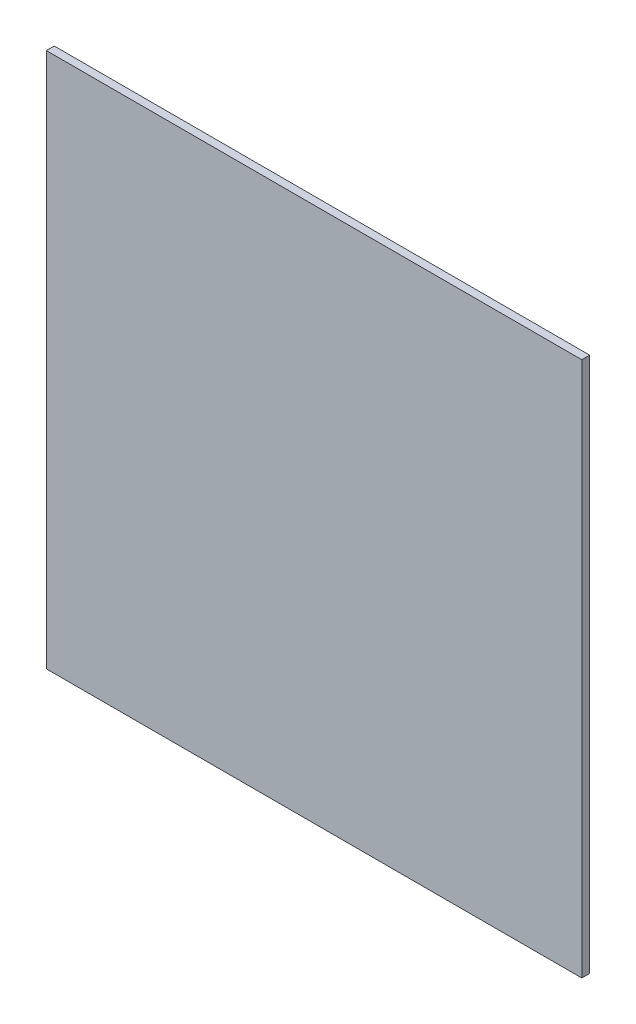
ISO-10303-21;
HEADER;
FILE_DESCRIPTION(('STEP AP214'),'2;1');
FILE_NAME('part.step','',(''),(''),'','','');
FILE_SCHEMA(('AUTOMOTIVE_DESIGN { 1 0 10303 214 1 1 1 1 }'));
ENDSEC;
DATA;
#1=APPLICATION_CONTEXT('core data for automotive mechanical design processes');
#2=APPLICATION_PROTOCOL_DEFINITION('international standard','automotive_design',2000,#1);
#3=PRODUCT_CONTEXT('',#1,'mechanical');
#4=PRODUCT('Part','Part','',(#3));
#5=PRODUCT_RELATED_PRODUCT_CATEGORY('part','',(#4));
#6=PRODUCT_DEFINITION_FORMATION('','',#4);
#7=PRODUCT_DEFINITION_CONTEXT('part definition',#1,'design');
#8=PRODUCT_DEFINITION('design','',#6,#7);
#9=PRODUCT_DEFINITION_SHAPE('','',#8);
#10=(LENGTH_UNIT() NAMED_UNIT(*) SI_UNIT(.MILLI.,.METRE.));
#11=(NAMED_UNIT(*) PLANE_ANGLE_UNIT() SI_UNIT($,.RADIAN.));
#12=(NAMED_UNIT(*) SI_UNIT($,.STERADIAN.) SOLID_ANGLE_UNIT());
#13=UNCERTAINTY_MEASURE_WITH_UNIT(LENGTH_MEASURE(1.E-05),#10,'distance_accuracy_value','');
#14=(GEOMETRIC_REPRESENTATION_CONTEXT(3) GLOBAL_UNCERTAINTY_ASSIGNED_CONTEXT((#13)) GLOBAL_UNIT_ASSIGNED_CONTEXT((#10,
#11,#12)) REPRESENTATION_CONTEXT('',''));
#15=CARTESIAN_POINT('',(0.,0.,0.));
#16=DIRECTION('',(0.,0.,1.));
#17=DIRECTION('',(1.,0.,0.));
#18=AXIS2_PLACEMENT_3D('',#15,#16,#17);
#19=CARTESIAN_POINT('',(-610.,-610.,-10.));
#20=DIRECTION('',(-1.,0.,0.));
#21=DIRECTION('',(0.,0.,1.));
#22=AXIS2_PLACEMENT_3D('',#19,#20,#21);
#23=PLANE('',#22);
#24=DIRECTION('',(0.,-1.,0.));
#25=VECTOR('',#24,1.);
#26=CARTESIAN_POINT('',(-610.,-610.,8.));
#27=LINE('',#26,#25);
#28=CARTESIAN_POINT('',(-610.,610.,8.));
#29=VERTEX_POINT('',#28);
#30=CARTESIAN_POINT('',(-610.,-610.,8.));
#31=VERTEX_POINT('',#30);
#32=EDGE_CURVE('E98',#29,#31,#27,.T.);
#33=ORIENTED_EDGE('',*,*,#32,.F.);
#34=DIRECTION('',(0.,0.,1.));
#35=VECTOR('',#34,1.);
#36=CARTESIAN_POINT('',(-610.,610.,-10.));
#37=LINE('',#36,#35);
#38=CARTESIAN_POINT('',(-610.,610.,-10.));
#39=VERTEX_POINT('',#38);
#40=EDGE_CURVE('E11',#39,#29,#37,.T.);
#41=ORIENTED_EDGE('',*,*,#40,.F.);
#42=DIRECTION('',(0.,-1.,0.));
#43=VECTOR('',#42,1.);
#44=CARTESIAN_POINT('',(-610.,-610.,-10.));
#45=LINE('',#44,#43);
#46=CARTESIAN_POINT('',(-610.,-610.,-10.));
#47=VERTEX_POINT('',#46);
#48=EDGE_CURVE('E92',#39,#47,#45,.T.);
#49=ORIENTED_EDGE('',*,*,#48,.T.);
#50=DIRECTION('',(0.,0.,1.));
#51=VECTOR('',#50,1.);
#52=CARTESIAN_POINT('',(-610.,-610.,-10.));
#53=LINE('',#52,#51);
#54=EDGE_CURVE('E37',#47,#31,#53,.T.);
#55=ORIENTED_EDGE('',*,*,#54,.T.);
#56=EDGE_LOOP('',(#33,#41,#49,#55));
#57=FACE_BOUND('',#56,.T.);
#58=ADVANCED_FACE('F34',(#57),#23,.T.);
#59=CARTESIAN_POINT('',(610.,610.,-10.));
#60=DIRECTION('',(0.,1.,0.));
#61=DIRECTION('',(-1.,0.,0.));
#62=AXIS2_PLACEMENT_3D('',#59,#60,#61);
#63=PLANE('',#62);
#64=DIRECTION('',(-1.,0.,0.));
#65=VECTOR('',#64,1.);
#66=CARTESIAN_POINT('',(610.,610.,8.));
#67=LINE('',#66,#65);
#68=CARTESIAN_POINT('',(610.,610.,8.));
#69=VERTEX_POINT('',#68);
#70=EDGE_CURVE('E94',#69,#29,#67,.T.);
#71=ORIENTED_EDGE('',*,*,#70,.F.);
#72=DIRECTION('',(0.,0.,1.));
#73=VECTOR('',#72,1.);
#74=CARTESIAN_POINT('',(610.,610.,-10.));
#75=LINE('',#74,#73);
#76=CARTESIAN_POINT('',(610.,610.,-10.));
#77=VERTEX_POINT('',#76);
#78=EDGE_CURVE('E43',#77,#69,#75,.T.);
#79=ORIENTED_EDGE('',*,*,#78,.F.);
#80=DIRECTION('',(-1.,0.,0.));
#81=VECTOR('',#80,1.);
#82=CARTESIAN_POINT('',(610.,610.,-10.));
#83=LINE('',#82,#81);
#84=EDGE_CURVE('E89',#77,#39,#83,.T.);
#85=ORIENTED_EDGE('',*,*,#84,.T.);
#86=ORIENTED_EDGE('',*,*,#40,.T.);
#87=EDGE_LOOP('',(#71,#79,#85,#86));
#88=FACE_BOUND('',#87,.T.);
#89=ADVANCED_FACE('F108',(#88),#63,.T.);
#90=CARTESIAN_POINT('',(610.,-610.,-10.));
#91=DIRECTION('',(1.,0.,0.));
#92=DIRECTION('',(0.,0.,-1.));
#93=AXIS2_PLACEMENT_3D('',#90,#91,#92);
#94=PLANE('',#93);
#95=DIRECTION('',(0.,1.,0.));
#96=VECTOR('',#95,1.);
#97=CARTESIAN_POINT('',(610.,-610.,8.));
#98=LINE('',#97,#96);
#99=CARTESIAN_POINT('',(610.,-610.,8.));
#100=VERTEX_POINT('',#99);
#101=EDGE_CURVE('E84',#100,#69,#98,.T.);
#102=ORIENTED_EDGE('',*,*,#101,.F.);
#103=DIRECTION('',(0.,0.,1.));
#104=VECTOR('',#103,1.);
#105=CARTESIAN_POINT('',(610.,-610.,-10.));
#106=LINE('',#105,#104);
#107=CARTESIAN_POINT('',(610.,-610.,-10.));
#108=VERTEX_POINT('',#107);
#109=EDGE_CURVE('E79',#108,#100,#106,.T.);
#110=ORIENTED_EDGE('',*,*,#109,.F.);
#111=DIRECTION('',(0.,1.,0.));
#112=VECTOR('',#111,1.);
#113=CARTESIAN_POINT('',(610.,-610.,-10.));
#114=LINE('',#113,#112);
#115=EDGE_CURVE('E82',#108,#77,#114,.T.);
#116=ORIENTED_EDGE('',*,*,#115,.T.);
#117=ORIENTED_EDGE('',*,*,#78,.T.);
#118=EDGE_LOOP('',(#102,#110,#116,#117));
#119=FACE_BOUND('',#118,.T.);
#120=ADVANCED_FACE('F81',(#119),#94,.T.);
#121=CARTESIAN_POINT('',(610.,-610.,-10.));
#122=DIRECTION('',(0.,-1.,0.));
#123=DIRECTION('',(1.,0.,0.));
#124=AXIS2_PLACEMENT_3D('',#121,#122,#123);
#125=PLANE('',#124);
#126=DIRECTION('',(1.,0.,0.));
#127=VECTOR('',#126,1.);
#128=CARTESIAN_POINT('',(610.,-610.,8.));
#129=LINE('',#128,#127);
#130=EDGE_CURVE('E101',#31,#100,#129,.T.);
#131=ORIENTED_EDGE('',*,*,#130,.F.);
#132=ORIENTED_EDGE('',*,*,#54,.F.);
#133=DIRECTION('',(1.,0.,0.));
#134=VECTOR('',#133,1.);
#135=CARTESIAN_POINT('',(610.,-610.,-10.));
#136=LINE('',#135,#134);
#137=EDGE_CURVE('E88',#47,#108,#136,.T.);
#138=ORIENTED_EDGE('',*,*,#137,.T.);
#139=ORIENTED_EDGE('',*,*,#109,.T.);
#140=EDGE_LOOP('',(#131,#132,#138,#139));
#141=FACE_BOUND('',#140,.T.);
#142=ADVANCED_FACE('F91',(#141),#125,.T.);
#143=CARTESIAN_POINT('',(0.,0.,-10.));
#144=DIRECTION('',(0.,0.,1.));
#145=DIRECTION('',(1.,0.,0.));
#146=AXIS2_PLACEMENT_3D('',#143,#144,#145);
#147=PLANE('',#146);
#148=ORIENTED_EDGE('',*,*,#48,.F.);
#149=ORIENTED_EDGE('',*,*,#84,.F.);
#150=ORIENTED_EDGE('',*,*,#115,.F.);
#151=ORIENTED_EDGE('',*,*,#137,.F.);
#152=EDGE_LOOP('',(#148,#149,#150,#151));
#153=FACE_BOUND('',#152,.T.);
#154=ADVANCED_FACE('F87',(#153),#147,.F.);
#155=CARTESIAN_POINT('',(0.,0.,8.));
#156=DIRECTION('',(0.,0.,1.));
#157=DIRECTION('',(1.,0.,0.));
#158=AXIS2_PLACEMENT_3D('',#155,#156,#157);
#159=PLANE('',#158);
#160=ORIENTED_EDGE('',*,*,#32,.T.);
#161=ORIENTED_EDGE('',*,*,#130,.T.);
#162=ORIENTED_EDGE('',*,*,#101,.T.);
#163=ORIENTED_EDGE('',*,*,#70,.T.);
#164=EDGE_LOOP('',(#160,#161,#162,#163));
#165=FACE_BOUND('',#164,.T.);
#166=ADVANCED_FACE('F107',(#165),#159,.T.);
#167=CLOSED_SHELL('',(#58,#89,#120,#142,#154,#166));
#168=MANIFOLD_SOLID_BREP('B2',#167);
#169=ADVANCED_BREP_SHAPE_REPRESENTATION('',(#18,#168),#14);
#170=SHAPE_DEFINITION_REPRESENTATION(#9,#169);
ENDSEC;
END-ISO-10303-21;
